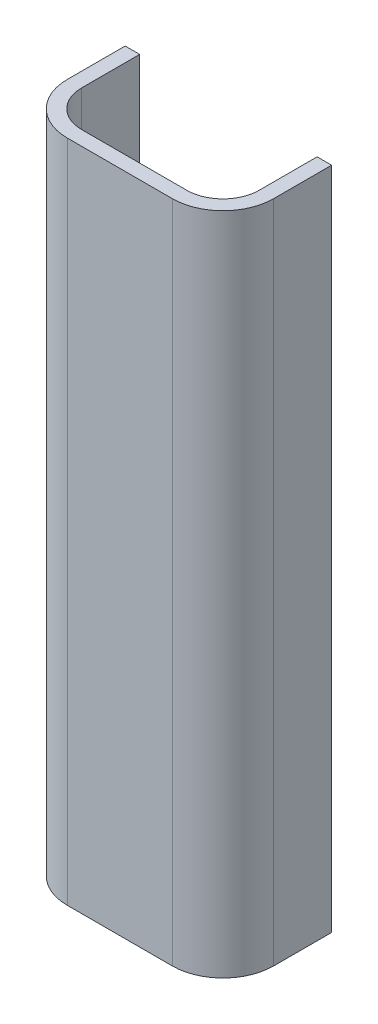
ISO-10303-21;
HEADER;
FILE_DESCRIPTION(('STEP AP214'),'2;1');
FILE_NAME('part.step','',(''),(''),'','','');
FILE_SCHEMA(('AUTOMOTIVE_DESIGN { 1 0 10303 214 1 1 1 1 }'));
ENDSEC;
DATA;
#1=APPLICATION_CONTEXT('core data for automotive mechanical design processes');
#2=APPLICATION_PROTOCOL_DEFINITION('international standard','automotive_design',2000,#1);
#3=PRODUCT_CONTEXT('',#1,'mechanical');
#4=PRODUCT('Part','Part','',(#3));
#5=PRODUCT_RELATED_PRODUCT_CATEGORY('part','',(#4));
#6=PRODUCT_DEFINITION_FORMATION('','',#4);
#7=PRODUCT_DEFINITION_CONTEXT('part definition',#1,'design');
#8=PRODUCT_DEFINITION('design','',#6,#7);
#9=PRODUCT_DEFINITION_SHAPE('','',#8);
#10=(LENGTH_UNIT() NAMED_UNIT(*) SI_UNIT(.MILLI.,.METRE.));
#11=(NAMED_UNIT(*) PLANE_ANGLE_UNIT() SI_UNIT($,.RADIAN.));
#12=(NAMED_UNIT(*) SI_UNIT($,.STERADIAN.) SOLID_ANGLE_UNIT());
#13=UNCERTAINTY_MEASURE_WITH_UNIT(LENGTH_MEASURE(1.E-05),#10,'distance_accuracy_value','');
#14=(GEOMETRIC_REPRESENTATION_CONTEXT(3) GLOBAL_UNCERTAINTY_ASSIGNED_CONTEXT((#13)) GLOBAL_UNIT_ASSIGNED_CONTEXT((#10,
#11,#12)) REPRESENTATION_CONTEXT('',''));
#15=CARTESIAN_POINT('',(0.,0.,0.));
#16=DIRECTION('',(0.,0.,1.));
#17=DIRECTION('',(1.,0.,0.));
#18=AXIS2_PLACEMENT_3D('',#15,#16,#17);
#19=CARTESIAN_POINT('',(0.,110.,228.149030702734));
#20=DIRECTION('',(0.,1.,0.));
#21=DIRECTION('',(0.,0.,1.));
#22=AXIS2_PLACEMENT_3D('',#19,#20,#21);
#23=PLANE('',#22);
#24=DIRECTION('',(1.,0.,0.));
#25=VECTOR('',#24,1.);
#26=CARTESIAN_POINT('',(0.,110.,0.));
#27=LINE('',#26,#25);
#28=CARTESIAN_POINT('',(24.5,110.,0.));
#29=VERTEX_POINT('',#28);
#30=CARTESIAN_POINT('',(28.5,110.,0.));
#31=VERTEX_POINT('',#30);
#32=EDGE_CURVE('E167',#29,#31,#27,.T.);
#33=ORIENTED_EDGE('',*,*,#32,.F.);
#34=DIRECTION('',(0.,0.,-1.));
#35=VECTOR('',#34,1.);
#36=CARTESIAN_POINT('',(24.5,110.,0.));
#37=LINE('',#36,#35);
#38=CARTESIAN_POINT('',(24.5,110.,16.));
#39=VERTEX_POINT('',#38);
#40=EDGE_CURVE('E159',#39,#29,#37,.T.);
#41=ORIENTED_EDGE('',*,*,#40,.F.);
#42=CARTESIAN_POINT('',(14.5,110.,16.));
#43=DIRECTION('',(0.,1.,0.));
#44=DIRECTION('',(0.,0.,1.));
#45=AXIS2_PLACEMENT_3D('',#42,#43,#44);
#46=CIRCLE('',#45,10.);
#47=CARTESIAN_POINT('',(14.5,110.,26.));
#48=VERTEX_POINT('',#47);
#49=EDGE_CURVE('E238',#39,#48,#46,.F.);
#50=ORIENTED_EDGE('',*,*,#49,.T.);
#51=DIRECTION('',(-1.,0.,0.));
#52=VECTOR('',#51,1.);
#53=CARTESIAN_POINT('',(0.,110.,26.));
#54=LINE('',#53,#52);
#55=CARTESIAN_POINT('',(-14.5,110.,26.));
#56=VERTEX_POINT('',#55);
#57=EDGE_CURVE('E243',#48,#56,#54,.T.);
#58=ORIENTED_EDGE('',*,*,#57,.T.);
#59=CARTESIAN_POINT('',(-14.5,110.,16.));
#60=DIRECTION('',(0.,1.,0.));
#61=DIRECTION('',(0.,0.,1.));
#62=AXIS2_PLACEMENT_3D('',#59,#60,#61);
#63=CIRCLE('',#62,10.);
#64=CARTESIAN_POINT('',(-24.5,110.,16.));
#65=VERTEX_POINT('',#64);
#66=EDGE_CURVE('E156',#56,#65,#63,.F.);
#67=ORIENTED_EDGE('',*,*,#66,.T.);
#68=DIRECTION('',(0.,0.,1.));
#69=VECTOR('',#68,1.);
#70=CARTESIAN_POINT('',(-24.5,110.,0.));
#71=LINE('',#70,#69);
#72=CARTESIAN_POINT('',(-24.5,110.,0.));
#73=VERTEX_POINT('',#72);
#74=EDGE_CURVE('E137',#73,#65,#71,.T.);
#75=ORIENTED_EDGE('',*,*,#74,.F.);
#76=CARTESIAN_POINT('',(-28.5,110.,0.));
#77=VERTEX_POINT('',#76);
#78=EDGE_CURVE('E153',#77,#73,#27,.T.);
#79=ORIENTED_EDGE('',*,*,#78,.F.);
#80=DIRECTION('',(0.,0.,-1.));
#81=VECTOR('',#80,1.);
#82=CARTESIAN_POINT('',(-28.5,110.,228.149030702734));
#83=LINE('',#82,#81);
#84=CARTESIAN_POINT('',(-28.5,110.,16.));
#85=VERTEX_POINT('',#84);
#86=EDGE_CURVE('E184',#85,#77,#83,.T.);
#87=ORIENTED_EDGE('',*,*,#86,.F.);
#88=CARTESIAN_POINT('',(-14.5,110.,16.));
#89=DIRECTION('',(0.,1.,0.));
#90=DIRECTION('',(0.,0.,1.));
#91=AXIS2_PLACEMENT_3D('',#88,#89,#90);
#92=CIRCLE('',#91,14.);
#93=CARTESIAN_POINT('',(-14.5,110.,30.));
#94=VERTEX_POINT('',#93);
#95=EDGE_CURVE('E210',#85,#94,#92,.T.);
#96=ORIENTED_EDGE('',*,*,#95,.T.);
#97=DIRECTION('',(-1.,0.,0.));
#98=VECTOR('',#97,1.);
#99=CARTESIAN_POINT('',(0.,110.,30.));
#100=LINE('',#99,#98);
#101=CARTESIAN_POINT('',(14.5,110.,30.));
#102=VERTEX_POINT('',#101);
#103=EDGE_CURVE('E197',#102,#94,#100,.T.);
#104=ORIENTED_EDGE('',*,*,#103,.F.);
#105=CARTESIAN_POINT('',(14.5,110.,16.));
#106=DIRECTION('',(0.,1.,0.));
#107=DIRECTION('',(0.,0.,1.));
#108=AXIS2_PLACEMENT_3D('',#105,#106,#107);
#109=CIRCLE('',#108,14.);
#110=CARTESIAN_POINT('',(28.5,110.,16.));
#111=VERTEX_POINT('',#110);
#112=EDGE_CURVE('E213',#102,#111,#109,.T.);
#113=ORIENTED_EDGE('',*,*,#112,.T.);
#114=DIRECTION('',(0.,0.,-1.));
#115=VECTOR('',#114,1.);
#116=CARTESIAN_POINT('',(28.5,110.,228.149030702734));
#117=LINE('',#116,#115);
#118=EDGE_CURVE('E179',#111,#31,#117,.T.);
#119=ORIENTED_EDGE('',*,*,#118,.T.);
#120=EDGE_LOOP('',(#33,#41,#50,#58,#67,#75,#79,#87,#96,#104,#113,#119));
#121=FACE_BOUND('',#120,.T.);
#122=ADVANCED_FACE('F41',(#121),#23,.T.);
#123=CARTESIAN_POINT('',(0.,0.,0.));
#124=DIRECTION('',(0.,0.,1.));
#125=DIRECTION('',(1.,0.,0.));
#126=AXIS2_PLACEMENT_3D('',#123,#124,#125);
#127=PLANE('',#126);
#128=DIRECTION('',(0.,-1.,0.));
#129=VECTOR('',#128,1.);
#130=CARTESIAN_POINT('',(24.5,0.,0.));
#131=LINE('',#130,#129);
#132=CARTESIAN_POINT('',(24.5,-69.5,0.));
#133=VERTEX_POINT('',#132);
#134=EDGE_CURVE('E180',#29,#133,#131,.T.);
#135=ORIENTED_EDGE('',*,*,#134,.F.);
#136=ORIENTED_EDGE('',*,*,#32,.T.);
#137=DIRECTION('',(0.,-1.,0.));
#138=VECTOR('',#137,1.);
#139=CARTESIAN_POINT('',(28.5,0.,0.));
#140=LINE('',#139,#138);
#141=CARTESIAN_POINT('',(28.5,-73.5,0.));
#142=VERTEX_POINT('',#141);
#143=EDGE_CURVE('E147',#31,#142,#140,.T.);
#144=ORIENTED_EDGE('',*,*,#143,.T.);
#145=DIRECTION('',(1.,0.,0.));
#146=VECTOR('',#145,1.);
#147=CARTESIAN_POINT('',(0.,-73.5,0.));
#148=LINE('',#147,#146);
#149=CARTESIAN_POINT('',(-28.5,-73.5,0.));
#150=VERTEX_POINT('',#149);
#151=EDGE_CURVE('E190',#150,#142,#148,.T.);
#152=ORIENTED_EDGE('',*,*,#151,.F.);
#153=DIRECTION('',(0.,-1.,0.));
#154=VECTOR('',#153,1.);
#155=CARTESIAN_POINT('',(-28.5,0.,0.));
#156=LINE('',#155,#154);
#157=EDGE_CURVE('E165',#77,#150,#156,.T.);
#158=ORIENTED_EDGE('',*,*,#157,.F.);
#159=ORIENTED_EDGE('',*,*,#78,.T.);
#160=DIRECTION('',(0.,-1.,0.));
#161=VECTOR('',#160,1.);
#162=CARTESIAN_POINT('',(-24.5,0.,0.));
#163=LINE('',#162,#161);
#164=CARTESIAN_POINT('',(-24.5,-69.5,0.));
#165=VERTEX_POINT('',#164);
#166=EDGE_CURVE('E133',#73,#165,#163,.T.);
#167=ORIENTED_EDGE('',*,*,#166,.T.);
#168=DIRECTION('',(1.,0.,0.));
#169=VECTOR('',#168,1.);
#170=CARTESIAN_POINT('',(0.,-69.5,0.));
#171=LINE('',#170,#169);
#172=EDGE_CURVE('E146',#165,#133,#171,.T.);
#173=ORIENTED_EDGE('',*,*,#172,.T.);
#174=EDGE_LOOP('',(#135,#136,#144,#152,#158,#159,#167,#173));
#175=FACE_BOUND('',#174,.T.);
#176=ADVANCED_FACE('F162',(#175),#127,.F.);
#177=CARTESIAN_POINT('',(24.5,0.,228.149030702734));
#178=DIRECTION('',(1.,0.,0.));
#179=DIRECTION('',(0.,1.,0.));
#180=AXIS2_PLACEMENT_3D('',#177,#178,#179);
#181=PLANE('',#180);
#182=DIRECTION('',(0.,-1.,0.));
#183=VECTOR('',#182,1.);
#184=CARTESIAN_POINT('',(24.5,156.960769224964,16.));
#185=LINE('',#184,#183);
#186=CARTESIAN_POINT('',(24.5,-69.5,16.));
#187=VERTEX_POINT('',#186);
#188=EDGE_CURVE('E158',#39,#187,#185,.T.);
#189=ORIENTED_EDGE('',*,*,#188,.F.);
#190=ORIENTED_EDGE('',*,*,#40,.T.);
#191=ORIENTED_EDGE('',*,*,#134,.T.);
#192=DIRECTION('',(0.,0.,-1.));
#193=VECTOR('',#192,1.);
#194=CARTESIAN_POINT('',(24.5,-69.5,228.149030702734));
#195=LINE('',#194,#193);
#196=EDGE_CURVE('E176',#187,#133,#195,.T.);
#197=ORIENTED_EDGE('',*,*,#196,.F.);
#198=EDGE_LOOP('',(#189,#190,#191,#197));
#199=FACE_BOUND('',#198,.T.);
#200=ADVANCED_FACE('F291',(#199),#181,.F.);
#201=CARTESIAN_POINT('',(0.,-69.5,228.149030702734));
#202=DIRECTION('',(0.,1.,0.));
#203=DIRECTION('',(0.,0.,1.));
#204=AXIS2_PLACEMENT_3D('',#201,#202,#203);
#205=PLANE('',#204);
#206=DIRECTION('',(-1.,0.,0.));
#207=VECTOR('',#206,1.);
#208=CARTESIAN_POINT('',(0.,-69.5,26.));
#209=LINE('',#208,#207);
#210=CARTESIAN_POINT('',(14.5,-69.5,26.));
#211=VERTEX_POINT('',#210);
#212=CARTESIAN_POINT('',(-14.5,-69.5,26.));
#213=VERTEX_POINT('',#212);
#214=EDGE_CURVE('E255',#211,#213,#209,.T.);
#215=ORIENTED_EDGE('',*,*,#214,.F.);
#216=CARTESIAN_POINT('',(14.5,-69.5,16.));
#217=DIRECTION('',(0.,1.,0.));
#218=DIRECTION('',(0.,0.,1.));
#219=AXIS2_PLACEMENT_3D('',#216,#217,#218);
#220=CIRCLE('',#219,10.);
#221=EDGE_CURVE('E260',#187,#211,#220,.F.);
#222=ORIENTED_EDGE('',*,*,#221,.F.);
#223=ORIENTED_EDGE('',*,*,#196,.T.);
#224=ORIENTED_EDGE('',*,*,#172,.F.);
#225=DIRECTION('',(0.,0.,-1.));
#226=VECTOR('',#225,1.);
#227=CARTESIAN_POINT('',(-24.5,-69.5,228.149030702734));
#228=LINE('',#227,#226);
#229=CARTESIAN_POINT('',(-24.5,-69.5,16.));
#230=VERTEX_POINT('',#229);
#231=EDGE_CURVE('E140',#230,#165,#228,.T.);
#232=ORIENTED_EDGE('',*,*,#231,.F.);
#233=CARTESIAN_POINT('',(-14.5,-69.5,16.));
#234=DIRECTION('',(0.,1.,0.));
#235=DIRECTION('',(0.,0.,1.));
#236=AXIS2_PLACEMENT_3D('',#233,#234,#235);
#237=CIRCLE('',#236,10.);
#238=EDGE_CURVE('E250',#213,#230,#237,.F.);
#239=ORIENTED_EDGE('',*,*,#238,.F.);
#240=EDGE_LOOP('',(#215,#222,#223,#224,#232,#239));
#241=FACE_BOUND('',#240,.T.);
#242=ADVANCED_FACE('F298',(#241),#205,.T.);
#243=CARTESIAN_POINT('',(-24.5,0.,228.149030702734));
#244=DIRECTION('',(1.,0.,0.));
#245=DIRECTION('',(0.,1.,0.));
#246=AXIS2_PLACEMENT_3D('',#243,#244,#245);
#247=PLANE('',#246);
#248=ORIENTED_EDGE('',*,*,#166,.F.);
#249=ORIENTED_EDGE('',*,*,#74,.T.);
#250=DIRECTION('',(0.,-1.,0.));
#251=VECTOR('',#250,1.);
#252=CARTESIAN_POINT('',(-24.5,156.960769224964,16.));
#253=LINE('',#252,#251);
#254=EDGE_CURVE('E253',#65,#230,#253,.T.);
#255=ORIENTED_EDGE('',*,*,#254,.T.);
#256=ORIENTED_EDGE('',*,*,#231,.T.);
#257=EDGE_LOOP('',(#248,#249,#255,#256));
#258=FACE_BOUND('',#257,.T.);
#259=ADVANCED_FACE('F135',(#258),#247,.T.);
#260=CARTESIAN_POINT('',(-28.5,0.,228.149030702734));
#261=DIRECTION('',(1.,0.,0.));
#262=DIRECTION('',(0.,0.,-1.));
#263=AXIS2_PLACEMENT_3D('',#260,#261,#262);
#264=PLANE('',#263);
#265=DIRECTION('',(0.,0.,-1.));
#266=VECTOR('',#265,1.);
#267=CARTESIAN_POINT('',(-28.5,-73.5,228.149030702734));
#268=LINE('',#267,#266);
#269=CARTESIAN_POINT('',(-28.5,-73.5,16.));
#270=VERTEX_POINT('',#269);
#271=EDGE_CURVE('E187',#270,#150,#268,.T.);
#272=ORIENTED_EDGE('',*,*,#271,.F.);
#273=DIRECTION('',(0.,1.,0.));
#274=VECTOR('',#273,1.);
#275=CARTESIAN_POINT('',(-28.5,0.,16.));
#276=LINE('',#275,#274);
#277=EDGE_CURVE('E11',#270,#85,#276,.T.);
#278=ORIENTED_EDGE('',*,*,#277,.T.);
#279=ORIENTED_EDGE('',*,*,#86,.T.);
#280=ORIENTED_EDGE('',*,*,#157,.T.);
#281=EDGE_LOOP('',(#272,#278,#279,#280));
#282=FACE_BOUND('',#281,.T.);
#283=ADVANCED_FACE('F278',(#282),#264,.F.);
#284=CARTESIAN_POINT('',(0.,-73.5,228.149030702734));
#285=DIRECTION('',(0.,1.,0.));
#286=DIRECTION('',(-1.,0.,0.));
#287=AXIS2_PLACEMENT_3D('',#284,#285,#286);
#288=PLANE('',#287);
#289=DIRECTION('',(0.,0.,-1.));
#290=VECTOR('',#289,1.);
#291=CARTESIAN_POINT('',(28.5,-73.5,228.149030702734));
#292=LINE('',#291,#290);
#293=CARTESIAN_POINT('',(28.5,-73.5,16.));
#294=VERTEX_POINT('',#293);
#295=EDGE_CURVE('E183',#294,#142,#292,.T.);
#296=ORIENTED_EDGE('',*,*,#295,.F.);
#297=CARTESIAN_POINT('',(14.5,-73.5,16.));
#298=DIRECTION('',(0.,1.,0.));
#299=DIRECTION('',(-1.,0.,0.));
#300=AXIS2_PLACEMENT_3D('',#297,#298,#299);
#301=CIRCLE('',#300,14.);
#302=CARTESIAN_POINT('',(14.5,-73.5,30.));
#303=VERTEX_POINT('',#302);
#304=EDGE_CURVE('E50',#294,#303,#301,.F.);
#305=ORIENTED_EDGE('',*,*,#304,.T.);
#306=DIRECTION('',(-1.,0.,0.));
#307=VECTOR('',#306,1.);
#308=CARTESIAN_POINT('',(0.,-73.5,30.));
#309=LINE('',#308,#307);
#310=CARTESIAN_POINT('',(-14.5,-73.5,30.));
#311=VERTEX_POINT('',#310);
#312=EDGE_CURVE('E191',#303,#311,#309,.T.);
#313=ORIENTED_EDGE('',*,*,#312,.T.);
#314=CARTESIAN_POINT('',(-14.5,-73.5,16.));
#315=DIRECTION('',(0.,1.,0.));
#316=DIRECTION('',(-1.,0.,0.));
#317=AXIS2_PLACEMENT_3D('',#314,#315,#316);
#318=CIRCLE('',#317,14.);
#319=EDGE_CURVE('E57',#311,#270,#318,.F.);
#320=ORIENTED_EDGE('',*,*,#319,.T.);
#321=ORIENTED_EDGE('',*,*,#271,.T.);
#322=ORIENTED_EDGE('',*,*,#151,.T.);
#323=EDGE_LOOP('',(#296,#305,#313,#320,#321,#322));
#324=FACE_BOUND('',#323,.T.);
#325=ADVANCED_FACE('F222',(#324),#288,.F.);
#326=CARTESIAN_POINT('',(28.5,0.,228.149030702734));
#327=DIRECTION('',(1.,0.,0.));
#328=DIRECTION('',(0.,1.,0.));
#329=AXIS2_PLACEMENT_3D('',#326,#327,#328);
#330=PLANE('',#329);
#331=ORIENTED_EDGE('',*,*,#118,.F.);
#332=DIRECTION('',(0.,1.,0.));
#333=VECTOR('',#332,1.);
#334=CARTESIAN_POINT('',(28.5,-73.5,16.));
#335=LINE('',#334,#333);
#336=EDGE_CURVE('E65',#111,#294,#335,.F.);
#337=ORIENTED_EDGE('',*,*,#336,.T.);
#338=ORIENTED_EDGE('',*,*,#295,.T.);
#339=ORIENTED_EDGE('',*,*,#143,.F.);
#340=EDGE_LOOP('',(#331,#337,#338,#339));
#341=FACE_BOUND('',#340,.T.);
#342=ADVANCED_FACE('F232',(#341),#330,.T.);
#343=CARTESIAN_POINT('',(10.5,-67.5,30.));
#344=DIRECTION('',(0.,0.,-1.));
#345=DIRECTION('',(1.,0.,0.));
#346=AXIS2_PLACEMENT_3D('',#343,#344,#345);
#347=PLANE('',#346);
#348=ORIENTED_EDGE('',*,*,#312,.F.);
#349=DIRECTION('',(0.,1.,0.));
#350=VECTOR('',#349,1.);
#351=CARTESIAN_POINT('',(14.5,110.,30.));
#352=LINE('',#351,#350);
#353=EDGE_CURVE('E206',#303,#102,#352,.T.);
#354=ORIENTED_EDGE('',*,*,#353,.T.);
#355=ORIENTED_EDGE('',*,*,#103,.T.);
#356=DIRECTION('',(0.,1.,0.));
#357=VECTOR('',#356,1.);
#358=CARTESIAN_POINT('',(-14.5,-67.5,30.));
#359=LINE('',#358,#357);
#360=EDGE_CURVE('E201',#94,#311,#359,.F.);
#361=ORIENTED_EDGE('',*,*,#360,.T.);
#362=EDGE_LOOP('',(#348,#354,#355,#361));
#363=FACE_BOUND('',#362,.T.);
#364=ADVANCED_FACE('F227',(#363),#347,.F.);
#365=CARTESIAN_POINT('',(14.5,156.960769224964,16.));
#366=DIRECTION('',(0.,-1.,0.));
#367=DIRECTION('',(0.,0.,-1.));
#368=AXIS2_PLACEMENT_3D('',#365,#366,#367);
#369=CYLINDRICAL_SURFACE('',#368,10.);
#370=DIRECTION('',(0.,-1.,0.));
#371=VECTOR('',#370,1.);
#372=CARTESIAN_POINT('',(14.5,156.960769224964,26.));
#373=LINE('',#372,#371);
#374=EDGE_CURVE('E259',#48,#211,#373,.T.);
#375=ORIENTED_EDGE('',*,*,#374,.F.);
#376=ORIENTED_EDGE('',*,*,#49,.F.);
#377=ORIENTED_EDGE('',*,*,#188,.T.);
#378=ORIENTED_EDGE('',*,*,#221,.T.);
#379=EDGE_LOOP('',(#375,#376,#377,#378));
#380=FACE_BOUND('',#379,.T.);
#381=ADVANCED_FACE('F305',(#380),#369,.F.);
#382=CARTESIAN_POINT('',(0.,156.960769224964,26.));
#383=DIRECTION('',(0.,0.,1.));
#384=DIRECTION('',(1.,0.,0.));
#385=AXIS2_PLACEMENT_3D('',#382,#383,#384);
#386=PLANE('',#385);
#387=DIRECTION('',(0.,-1.,0.));
#388=VECTOR('',#387,1.);
#389=CARTESIAN_POINT('',(-14.5,156.960769224964,26.));
#390=LINE('',#389,#388);
#391=EDGE_CURVE('E254',#56,#213,#390,.T.);
#392=ORIENTED_EDGE('',*,*,#391,.F.);
#393=ORIENTED_EDGE('',*,*,#57,.F.);
#394=ORIENTED_EDGE('',*,*,#374,.T.);
#395=ORIENTED_EDGE('',*,*,#214,.T.);
#396=EDGE_LOOP('',(#392,#393,#394,#395));
#397=FACE_BOUND('',#396,.T.);
#398=ADVANCED_FACE('F310',(#397),#386,.F.);
#399=CARTESIAN_POINT('',(-14.5,156.960769224964,16.));
#400=DIRECTION('',(0.,-1.,0.));
#401=DIRECTION('',(0.,0.,-1.));
#402=AXIS2_PLACEMENT_3D('',#399,#400,#401);
#403=CYLINDRICAL_SURFACE('',#402,10.);
#404=ORIENTED_EDGE('',*,*,#254,.F.);
#405=ORIENTED_EDGE('',*,*,#66,.F.);
#406=ORIENTED_EDGE('',*,*,#391,.T.);
#407=ORIENTED_EDGE('',*,*,#238,.T.);
#408=EDGE_LOOP('',(#404,#405,#406,#407));
#409=FACE_BOUND('',#408,.T.);
#410=ADVANCED_FACE('F285',(#409),#403,.F.);
#411=CARTESIAN_POINT('',(14.5,-67.5,16.));
#412=DIRECTION('',(0.,-1.,0.));
#413=DIRECTION('',(1.,0.,0.));
#414=AXIS2_PLACEMENT_3D('',#411,#412,#413);
#415=CYLINDRICAL_SURFACE('',#414,14.);
#416=ORIENTED_EDGE('',*,*,#304,.F.);
#417=ORIENTED_EDGE('',*,*,#336,.F.);
#418=ORIENTED_EDGE('',*,*,#112,.F.);
#419=ORIENTED_EDGE('',*,*,#353,.F.);
#420=EDGE_LOOP('',(#416,#417,#418,#419));
#421=FACE_BOUND('',#420,.T.);
#422=ADVANCED_FACE('F230',(#421),#415,.T.);
#423=CARTESIAN_POINT('',(-14.5,0.,16.));
#424=DIRECTION('',(0.,1.,0.));
#425=DIRECTION('',(0.,0.,1.));
#426=AXIS2_PLACEMENT_3D('',#423,#424,#425);
#427=CYLINDRICAL_SURFACE('',#426,14.);
#428=ORIENTED_EDGE('',*,*,#319,.F.);
#429=ORIENTED_EDGE('',*,*,#360,.F.);
#430=ORIENTED_EDGE('',*,*,#95,.F.);
#431=ORIENTED_EDGE('',*,*,#277,.F.);
#432=EDGE_LOOP('',(#428,#429,#430,#431));
#433=FACE_BOUND('',#432,.T.);
#434=ADVANCED_FACE('F43',(#433),#427,.T.);
#435=CLOSED_SHELL('',(#122,#176,#200,#242,#259,#283,#325,#342,#364,#381,#398,#410,#422,#434));
#436=MANIFOLD_SOLID_BREP('B2',#435);
#437=ADVANCED_BREP_SHAPE_REPRESENTATION('',(#18,#436),#14);
#438=SHAPE_DEFINITION_REPRESENTATION(#9,#437);
ENDSEC;
END-ISO-10303-21;
